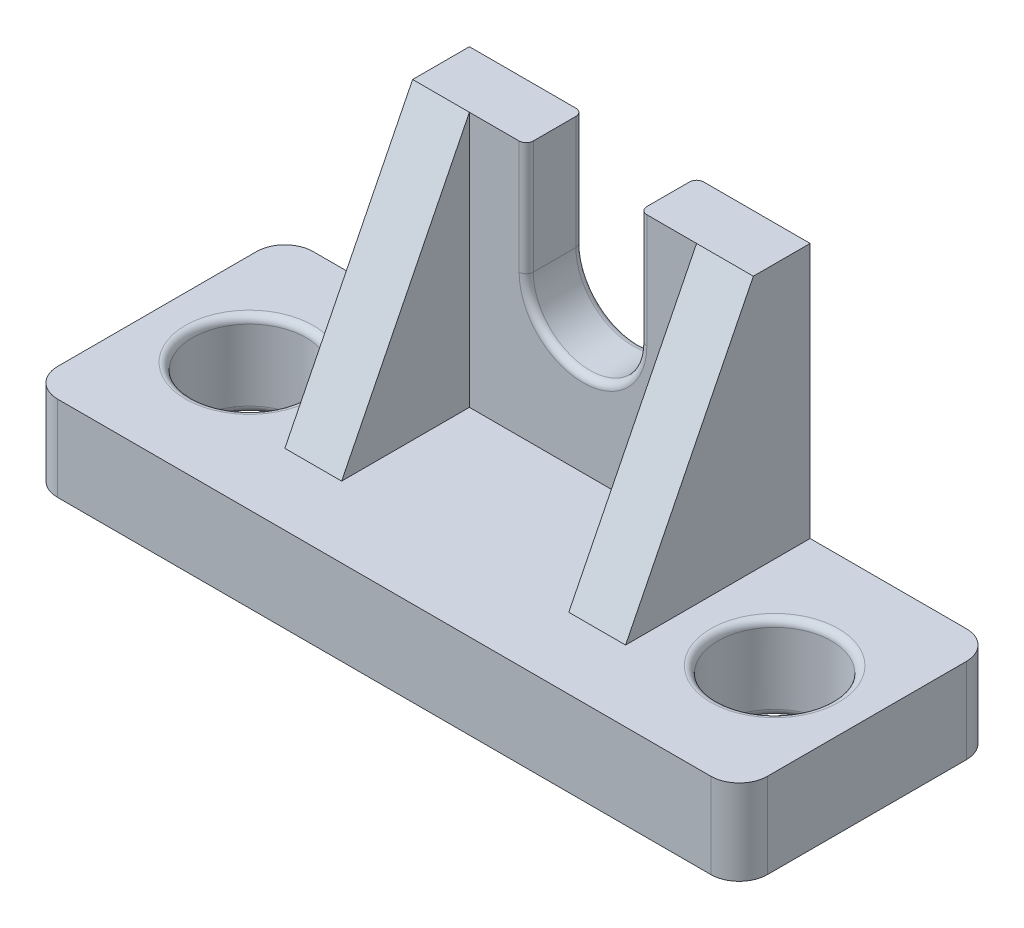
ISO-10303-21;
HEADER;
FILE_DESCRIPTION(('STEP AP214'),'2;1');
FILE_NAME('part.step','',(''),(''),'','','');
FILE_SCHEMA(('AUTOMOTIVE_DESIGN { 1 0 10303 214 1 1 1 1 }'));
ENDSEC;
DATA;
#1=APPLICATION_CONTEXT('core data for automotive mechanical design processes');
#2=APPLICATION_PROTOCOL_DEFINITION('international standard','automotive_design',2000,#1);
#3=PRODUCT_CONTEXT('',#1,'mechanical');
#4=PRODUCT('Part','Part','',(#3));
#5=PRODUCT_RELATED_PRODUCT_CATEGORY('part','',(#4));
#6=PRODUCT_DEFINITION_FORMATION('','',#4);
#7=PRODUCT_DEFINITION_CONTEXT('part definition',#1,'design');
#8=PRODUCT_DEFINITION('design','',#6,#7);
#9=PRODUCT_DEFINITION_SHAPE('','',#8);
#10=(LENGTH_UNIT() NAMED_UNIT(*) SI_UNIT(.MILLI.,.METRE.));
#11=(NAMED_UNIT(*) PLANE_ANGLE_UNIT() SI_UNIT($,.RADIAN.));
#12=(NAMED_UNIT(*) SI_UNIT($,.STERADIAN.) SOLID_ANGLE_UNIT());
#13=UNCERTAINTY_MEASURE_WITH_UNIT(LENGTH_MEASURE(1.E-05),#10,'distance_accuracy_value','');
#14=(GEOMETRIC_REPRESENTATION_CONTEXT(3) GLOBAL_UNCERTAINTY_ASSIGNED_CONTEXT((#13)) GLOBAL_UNIT_ASSIGNED_CONTEXT((#10,
#11,#12)) REPRESENTATION_CONTEXT('',''));
#15=CARTESIAN_POINT('',(0.,0.,0.));
#16=DIRECTION('',(0.,0.,1.));
#17=DIRECTION('',(1.,0.,0.));
#18=AXIS2_PLACEMENT_3D('',#15,#16,#17);
#19=CARTESIAN_POINT('',(0.,48.,0.));
#20=DIRECTION('',(0.,1.,0.));
#21=DIRECTION('',(0.,0.,1.));
#22=AXIS2_PLACEMENT_3D('',#19,#20,#21);
#23=PLANE('',#22);
#24=DIRECTION('',(0.,0.,1.));
#25=VECTOR('',#24,1.);
#26=CARTESIAN_POINT('',(42.,48.,-64.));
#27=LINE('',#26,#25);
#28=CARTESIAN_POINT('',(42.,48.,-35.));
#29=VERTEX_POINT('',#28);
#30=CARTESIAN_POINT('',(42.,48.,-29.));
#31=VERTEX_POINT('',#30);
#32=EDGE_CURVE('E381',#29,#31,#27,.T.);
#33=ORIENTED_EDGE('',*,*,#32,.F.);
#34=CARTESIAN_POINT('',(41.,48.,-35.));
#35=DIRECTION('',(0.,1.,0.));
#36=DIRECTION('',(0.,0.,1.));
#37=AXIS2_PLACEMENT_3D('',#34,#35,#36);
#38=CIRCLE('',#37,1.);
#39=CARTESIAN_POINT('',(41.,48.,-36.));
#40=VERTEX_POINT('',#39);
#41=EDGE_CURVE('E324',#29,#40,#38,.T.);
#42=ORIENTED_EDGE('',*,*,#41,.T.);
#43=DIRECTION('',(-1.,0.,0.));
#44=VECTOR('',#43,1.);
#45=CARTESIAN_POINT('',(26.,48.,-36.));
#46=LINE('',#45,#44);
#47=CARTESIAN_POINT('',(26.,48.,-36.));
#48=VERTEX_POINT('',#47);
#49=EDGE_CURVE('E219',#40,#48,#46,.T.);
#50=ORIENTED_EDGE('',*,*,#49,.T.);
#51=DIRECTION('',(0.,0.,1.));
#52=VECTOR('',#51,1.);
#53=CARTESIAN_POINT('',(26.,48.,-36.));
#54=LINE('',#53,#52);
#55=CARTESIAN_POINT('',(26.,48.,-28.));
#56=VERTEX_POINT('',#55);
#57=EDGE_CURVE('E220',#48,#56,#54,.T.);
#58=ORIENTED_EDGE('',*,*,#57,.T.);
#59=DIRECTION('',(-1.,0.,0.));
#60=VECTOR('',#59,1.);
#61=CARTESIAN_POINT('',(74.,48.,-28.));
#62=LINE('',#61,#60);
#63=CARTESIAN_POINT('',(34.,48.,-28.));
#64=VERTEX_POINT('',#63);
#65=EDGE_CURVE('E203',#64,#56,#62,.T.);
#66=ORIENTED_EDGE('',*,*,#65,.F.);
#67=DIRECTION('',(-1.,0.,0.));
#68=VECTOR('',#67,1.);
#69=CARTESIAN_POINT('',(34.,48.,-28.));
#70=LINE('',#69,#68);
#71=CARTESIAN_POINT('',(41.,48.,-28.));
#72=VERTEX_POINT('',#71);
#73=EDGE_CURVE('E392',#72,#64,#70,.T.);
#74=ORIENTED_EDGE('',*,*,#73,.F.);
#75=CARTESIAN_POINT('',(41.,48.,-29.));
#76=DIRECTION('',(0.,1.,0.));
#77=DIRECTION('',(0.,0.,1.));
#78=AXIS2_PLACEMENT_3D('',#75,#76,#77);
#79=CIRCLE('',#78,1.);
#80=EDGE_CURVE('E322',#72,#31,#79,.T.);
#81=ORIENTED_EDGE('',*,*,#80,.T.);
#82=EDGE_LOOP('',(#33,#42,#50,#58,#66,#74,#81));
#83=FACE_BOUND('',#82,.T.);
#84=ADVANCED_FACE('F37',(#83),#23,.T.);
#85=CARTESIAN_POINT('',(0.,0.,-36.));
#86=DIRECTION('',(-1.,0.,0.));
#87=DIRECTION('',(0.,0.,1.));
#88=AXIS2_PLACEMENT_3D('',#85,#86,#87);
#89=PLANE('',#88);
#90=DIRECTION('',(0.,0.,1.));
#91=VECTOR('',#90,1.);
#92=CARTESIAN_POINT('',(0.,12.,-36.));
#93=LINE('',#92,#91);
#94=CARTESIAN_POINT('',(0.,12.,-32.));
#95=VERTEX_POINT('',#94);
#96=CARTESIAN_POINT('',(0.,12.,-4.));
#97=VERTEX_POINT('',#96);
#98=EDGE_CURVE('E253',#95,#97,#93,.T.);
#99=ORIENTED_EDGE('',*,*,#98,.F.);
#100=DIRECTION('',(0.,-1.,0.));
#101=VECTOR('',#100,1.);
#102=CARTESIAN_POINT('',(0.,0.,-32.));
#103=LINE('',#102,#101);
#104=CARTESIAN_POINT('',(0.,0.,-32.));
#105=VERTEX_POINT('',#104);
#106=EDGE_CURVE('E299',#95,#105,#103,.T.);
#107=ORIENTED_EDGE('',*,*,#106,.T.);
#108=DIRECTION('',(0.,0.,1.));
#109=VECTOR('',#108,1.);
#110=CARTESIAN_POINT('',(0.,0.,-36.));
#111=LINE('',#110,#109);
#112=CARTESIAN_POINT('',(0.,0.,-4.));
#113=VERTEX_POINT('',#112);
#114=EDGE_CURVE('E248',#105,#113,#111,.T.);
#115=ORIENTED_EDGE('',*,*,#114,.T.);
#116=DIRECTION('',(0.,-1.,0.));
#117=VECTOR('',#116,1.);
#118=CARTESIAN_POINT('',(0.,12.,-4.));
#119=LINE('',#118,#117);
#120=EDGE_CURVE('E297',#113,#97,#119,.F.);
#121=ORIENTED_EDGE('',*,*,#120,.T.);
#122=EDGE_LOOP('',(#99,#107,#115,#121));
#123=FACE_BOUND('',#122,.T.);
#124=ADVANCED_FACE('F468',(#123),#89,.T.);
#125=CARTESIAN_POINT('',(0.,12.,-36.));
#126=DIRECTION('',(0.,1.,0.));
#127=DIRECTION('',(0.,0.,1.));
#128=AXIS2_PLACEMENT_3D('',#125,#126,#127);
#129=PLANE('',#128);
#130=CARTESIAN_POINT('',(87.,12.,-18.));
#131=DIRECTION('',(0.,1.,0.));
#132=DIRECTION('',(0.,0.,1.));
#133=AXIS2_PLACEMENT_3D('',#130,#131,#132);
#134=CIRCLE('',#133,9.);
#135=CARTESIAN_POINT('',(87.,12.,-9.));
#136=VERTEX_POINT('',#135);
#137=EDGE_CURVE('E351',#136,#136,#134,.F.);
#138=ORIENTED_EDGE('',*,*,#137,.T.);
#139=EDGE_LOOP('',(#138));
#140=FACE_BOUND('',#139,.T.);
#141=CARTESIAN_POINT('',(13.,12.,-18.));
#142=DIRECTION('',(0.,1.,0.));
#143=DIRECTION('',(0.,0.,1.));
#144=AXIS2_PLACEMENT_3D('',#141,#142,#143);
#145=CIRCLE('',#144,9.);
#146=CARTESIAN_POINT('',(13.,12.,-9.));
#147=VERTEX_POINT('',#146);
#148=EDGE_CURVE('E348',#147,#147,#145,.F.);
#149=ORIENTED_EDGE('',*,*,#148,.T.);
#150=EDGE_LOOP('',(#149));
#151=FACE_BOUND('',#150,.T.);
#152=DIRECTION('',(0.,0.,1.));
#153=VECTOR('',#152,1.);
#154=CARTESIAN_POINT('',(100.,12.,-36.));
#155=LINE('',#154,#153);
#156=CARTESIAN_POINT('',(100.,12.,-32.));
#157=VERTEX_POINT('',#156);
#158=CARTESIAN_POINT('',(100.,12.,-4.));
#159=VERTEX_POINT('',#158);
#160=EDGE_CURVE('E257',#157,#159,#155,.T.);
#161=ORIENTED_EDGE('',*,*,#160,.F.);
#162=CARTESIAN_POINT('',(96.,12.,-32.));
#163=DIRECTION('',(0.,1.,0.));
#164=DIRECTION('',(0.,0.,1.));
#165=AXIS2_PLACEMENT_3D('',#162,#163,#164);
#166=CIRCLE('',#165,4.);
#167=CARTESIAN_POINT('',(96.,12.,-36.));
#168=VERTEX_POINT('',#167);
#169=EDGE_CURVE('E277',#157,#168,#166,.T.);
#170=ORIENTED_EDGE('',*,*,#169,.T.);
#171=DIRECTION('',(-1.,0.,0.));
#172=VECTOR('',#171,1.);
#173=CARTESIAN_POINT('',(0.,12.,-36.));
#174=LINE('',#173,#172);
#175=CARTESIAN_POINT('',(74.,12.,-36.));
#176=VERTEX_POINT('',#175);
#177=EDGE_CURVE('E246',#168,#176,#174,.T.);
#178=ORIENTED_EDGE('',*,*,#177,.T.);
#179=DIRECTION('',(0.,0.,-1.));
#180=VECTOR('',#179,1.);
#181=CARTESIAN_POINT('',(74.,12.,-36.));
#182=LINE('',#181,#180);
#183=CARTESIAN_POINT('',(74.,12.,-10.));
#184=VERTEX_POINT('',#183);
#185=EDGE_CURVE('E225',#184,#176,#182,.T.);
#186=ORIENTED_EDGE('',*,*,#185,.F.);
#187=DIRECTION('',(1.,0.,0.));
#188=VECTOR('',#187,1.);
#189=CARTESIAN_POINT('',(26.,12.,-9.99999999999999));
#190=LINE('',#189,#188);
#191=CARTESIAN_POINT('',(66.,12.,-10.));
#192=VERTEX_POINT('',#191);
#193=EDGE_CURVE('E198',#192,#184,#190,.T.);
#194=ORIENTED_EDGE('',*,*,#193,.F.);
#195=DIRECTION('',(0.,0.,-1.));
#196=VECTOR('',#195,1.);
#197=CARTESIAN_POINT('',(66.,12.,-9.99999999999999));
#198=LINE('',#197,#196);
#199=CARTESIAN_POINT('',(66.,12.,-28.));
#200=VERTEX_POINT('',#199);
#201=EDGE_CURVE('E396',#192,#200,#198,.T.);
#202=ORIENTED_EDGE('',*,*,#201,.T.);
#203=DIRECTION('',(-1.,0.,0.));
#204=VECTOR('',#203,1.);
#205=CARTESIAN_POINT('',(34.,12.,-28.));
#206=LINE('',#205,#204);
#207=CARTESIAN_POINT('',(34.,12.,-28.));
#208=VERTEX_POINT('',#207);
#209=EDGE_CURVE('E399',#200,#208,#206,.T.);
#210=ORIENTED_EDGE('',*,*,#209,.T.);
#211=DIRECTION('',(0.,0.,1.));
#212=VECTOR('',#211,1.);
#213=CARTESIAN_POINT('',(34.,12.,-9.99999999999999));
#214=LINE('',#213,#212);
#215=CARTESIAN_POINT('',(34.,12.,-9.99999999999999));
#216=VERTEX_POINT('',#215);
#217=EDGE_CURVE('E393',#208,#216,#214,.T.);
#218=ORIENTED_EDGE('',*,*,#217,.T.);
#219=CARTESIAN_POINT('',(26.,12.,-9.99999999999999));
#220=VERTEX_POINT('',#219);
#221=EDGE_CURVE('E234',#220,#216,#190,.T.);
#222=ORIENTED_EDGE('',*,*,#221,.F.);
#223=DIRECTION('',(0.,0.,1.));
#224=VECTOR('',#223,1.);
#225=CARTESIAN_POINT('',(26.,12.,-36.));
#226=LINE('',#225,#224);
#227=CARTESIAN_POINT('',(26.,12.,-36.));
#228=VERTEX_POINT('',#227);
#229=EDGE_CURVE('E230',#228,#220,#226,.T.);
#230=ORIENTED_EDGE('',*,*,#229,.F.);
#231=CARTESIAN_POINT('',(4.,12.,-36.));
#232=VERTEX_POINT('',#231);
#233=EDGE_CURVE('E244',#228,#232,#174,.T.);
#234=ORIENTED_EDGE('',*,*,#233,.T.);
#235=CARTESIAN_POINT('',(4.,12.,-32.));
#236=DIRECTION('',(0.,1.,0.));
#237=DIRECTION('',(0.,0.,1.));
#238=AXIS2_PLACEMENT_3D('',#235,#236,#237);
#239=CIRCLE('',#238,4.);
#240=EDGE_CURVE('E273',#232,#95,#239,.T.);
#241=ORIENTED_EDGE('',*,*,#240,.T.);
#242=ORIENTED_EDGE('',*,*,#98,.T.);
#243=CARTESIAN_POINT('',(4.,12.,-4.));
#244=DIRECTION('',(0.,1.,0.));
#245=DIRECTION('',(0.,0.,1.));
#246=AXIS2_PLACEMENT_3D('',#243,#244,#245);
#247=CIRCLE('',#246,4.);
#248=CARTESIAN_POINT('',(4.,12.,0.));
#249=VERTEX_POINT('',#248);
#250=EDGE_CURVE('E271',#97,#249,#247,.T.);
#251=ORIENTED_EDGE('',*,*,#250,.T.);
#252=DIRECTION('',(-1.,0.,0.));
#253=VECTOR('',#252,1.);
#254=CARTESIAN_POINT('',(0.,12.,0.));
#255=LINE('',#254,#253);
#256=CARTESIAN_POINT('',(96.,12.,0.));
#257=VERTEX_POINT('',#256);
#258=EDGE_CURVE('E245',#257,#249,#255,.T.);
#259=ORIENTED_EDGE('',*,*,#258,.F.);
#260=CARTESIAN_POINT('',(96.,12.,-4.));
#261=DIRECTION('',(0.,1.,0.));
#262=DIRECTION('',(0.,0.,1.));
#263=AXIS2_PLACEMENT_3D('',#260,#261,#262);
#264=CIRCLE('',#263,4.);
#265=EDGE_CURVE('E275',#257,#159,#264,.T.);
#266=ORIENTED_EDGE('',*,*,#265,.T.);
#267=EDGE_LOOP('',(#161,#170,#178,#186,#194,#202,#210,#218,#222,#230,#234,#241,#242,#251,#259,#266));
#268=FACE_BOUND('',#267,.T.);
#269=ADVANCED_FACE('F413',(#140,#151,#268),#129,.T.);
#270=CARTESIAN_POINT('',(100.,0.,-36.));
#271=DIRECTION('',(1.,0.,0.));
#272=DIRECTION('',(0.,0.,-1.));
#273=AXIS2_PLACEMENT_3D('',#270,#271,#272);
#274=PLANE('',#273);
#275=DIRECTION('',(0.,0.,1.));
#276=VECTOR('',#275,1.);
#277=CARTESIAN_POINT('',(100.,0.,-36.));
#278=LINE('',#277,#276);
#279=CARTESIAN_POINT('',(100.,0.,-32.));
#280=VERTEX_POINT('',#279);
#281=CARTESIAN_POINT('',(100.,0.,-4.));
#282=VERTEX_POINT('',#281);
#283=EDGE_CURVE('E260',#280,#282,#278,.T.);
#284=ORIENTED_EDGE('',*,*,#283,.F.);
#285=DIRECTION('',(0.,1.,0.));
#286=VECTOR('',#285,1.);
#287=CARTESIAN_POINT('',(100.,0.,-32.));
#288=LINE('',#287,#286);
#289=EDGE_CURVE('E268',#280,#157,#288,.T.);
#290=ORIENTED_EDGE('',*,*,#289,.T.);
#291=ORIENTED_EDGE('',*,*,#160,.T.);
#292=DIRECTION('',(0.,1.,0.));
#293=VECTOR('',#292,1.);
#294=CARTESIAN_POINT('',(100.,0.,-4.));
#295=LINE('',#294,#293);
#296=EDGE_CURVE('E266',#159,#282,#295,.F.);
#297=ORIENTED_EDGE('',*,*,#296,.T.);
#298=EDGE_LOOP('',(#284,#290,#291,#297));
#299=FACE_BOUND('',#298,.T.);
#300=ADVANCED_FACE('F496',(#299),#274,.T.);
#301=CARTESIAN_POINT('',(0.,0.,-36.));
#302=DIRECTION('',(0.,-1.,0.));
#303=DIRECTION('',(0.,0.,-1.));
#304=AXIS2_PLACEMENT_3D('',#301,#302,#303);
#305=PLANE('',#304);
#306=CARTESIAN_POINT('',(13.,0.,-18.));
#307=DIRECTION('',(0.,-1.,0.));
#308=DIRECTION('',(0.,0.,-1.));
#309=AXIS2_PLACEMENT_3D('',#306,#307,#308);
#310=CIRCLE('',#309,9.);
#311=CARTESIAN_POINT('',(13.,0.,-27.));
#312=VERTEX_POINT('',#311);
#313=EDGE_CURVE('E339',#312,#312,#310,.F.);
#314=ORIENTED_EDGE('',*,*,#313,.T.);
#315=EDGE_LOOP('',(#314));
#316=FACE_BOUND('',#315,.T.);
#317=CARTESIAN_POINT('',(87.,0.,-18.));
#318=DIRECTION('',(0.,-1.,0.));
#319=DIRECTION('',(0.,0.,-1.));
#320=AXIS2_PLACEMENT_3D('',#317,#318,#319);
#321=CIRCLE('',#320,9.);
#322=CARTESIAN_POINT('',(87.,0.,-27.));
#323=VERTEX_POINT('',#322);
#324=EDGE_CURVE('E336',#323,#323,#321,.F.);
#325=ORIENTED_EDGE('',*,*,#324,.T.);
#326=EDGE_LOOP('',(#325));
#327=FACE_BOUND('',#326,.T.);
#328=DIRECTION('',(1.,0.,0.));
#329=VECTOR('',#328,1.);
#330=CARTESIAN_POINT('',(0.,0.,-36.));
#331=LINE('',#330,#329);
#332=CARTESIAN_POINT('',(4.,0.,-36.));
#333=VERTEX_POINT('',#332);
#334=CARTESIAN_POINT('',(96.,0.,-36.));
#335=VERTEX_POINT('',#334);
#336=EDGE_CURVE('E241',#333,#335,#331,.T.);
#337=ORIENTED_EDGE('',*,*,#336,.T.);
#338=CARTESIAN_POINT('',(96.,0.,-32.));
#339=DIRECTION('',(0.,-1.,0.));
#340=DIRECTION('',(0.,0.,-1.));
#341=AXIS2_PLACEMENT_3D('',#338,#339,#340);
#342=CIRCLE('',#341,4.);
#343=EDGE_CURVE('E289',#335,#280,#342,.T.);
#344=ORIENTED_EDGE('',*,*,#343,.T.);
#345=ORIENTED_EDGE('',*,*,#283,.T.);
#346=CARTESIAN_POINT('',(96.,0.,-4.));
#347=DIRECTION('',(0.,-1.,0.));
#348=DIRECTION('',(0.,0.,-1.));
#349=AXIS2_PLACEMENT_3D('',#346,#347,#348);
#350=CIRCLE('',#349,4.);
#351=CARTESIAN_POINT('',(96.,0.,0.));
#352=VERTEX_POINT('',#351);
#353=EDGE_CURVE('E287',#282,#352,#350,.T.);
#354=ORIENTED_EDGE('',*,*,#353,.T.);
#355=DIRECTION('',(1.,0.,0.));
#356=VECTOR('',#355,1.);
#357=CARTESIAN_POINT('',(0.,0.,0.));
#358=LINE('',#357,#356);
#359=CARTESIAN_POINT('',(4.,0.,0.));
#360=VERTEX_POINT('',#359);
#361=EDGE_CURVE('E240',#360,#352,#358,.T.);
#362=ORIENTED_EDGE('',*,*,#361,.F.);
#363=CARTESIAN_POINT('',(4.,0.,-4.));
#364=DIRECTION('',(0.,-1.,0.));
#365=DIRECTION('',(0.,0.,-1.));
#366=AXIS2_PLACEMENT_3D('',#363,#364,#365);
#367=CIRCLE('',#366,4.);
#368=EDGE_CURVE('E283',#360,#113,#367,.T.);
#369=ORIENTED_EDGE('',*,*,#368,.T.);
#370=ORIENTED_EDGE('',*,*,#114,.F.);
#371=CARTESIAN_POINT('',(4.,0.,-32.));
#372=DIRECTION('',(0.,-1.,0.));
#373=DIRECTION('',(0.,0.,-1.));
#374=AXIS2_PLACEMENT_3D('',#371,#372,#373);
#375=CIRCLE('',#374,4.);
#376=EDGE_CURVE('E285',#105,#333,#375,.T.);
#377=ORIENTED_EDGE('',*,*,#376,.T.);
#378=EDGE_LOOP('',(#337,#344,#345,#354,#362,#369,#370,#377));
#379=FACE_BOUND('',#378,.T.);
#380=ADVANCED_FACE('F490',(#316,#327,#379),#305,.T.);
#381=CARTESIAN_POINT('',(0.,0.,-36.));
#382=DIRECTION('',(0.,0.,-1.));
#383=DIRECTION('',(-1.,0.,0.));
#384=AXIS2_PLACEMENT_3D('',#381,#382,#383);
#385=PLANE('',#384);
#386=CARTESIAN_POINT('',(50.,32.,-36.));
#387=DIRECTION('',(0.,0.,-1.));
#388=DIRECTION('',(-1.,0.,0.));
#389=AXIS2_PLACEMENT_3D('',#386,#387,#388);
#390=CIRCLE('',#389,9.);
#391=CARTESIAN_POINT('',(41.,32.,-36.));
#392=VERTEX_POINT('',#391);
#393=CARTESIAN_POINT('',(59.,32.,-36.));
#394=VERTEX_POINT('',#393);
#395=EDGE_CURVE('E307',#392,#394,#390,.F.);
#396=ORIENTED_EDGE('',*,*,#395,.T.);
#397=DIRECTION('',(0.,-1.,0.));
#398=VECTOR('',#397,1.);
#399=CARTESIAN_POINT('',(59.,48.,-36.));
#400=LINE('',#399,#398);
#401=CARTESIAN_POINT('',(59.,48.,-36.));
#402=VERTEX_POINT('',#401);
#403=EDGE_CURVE('E311',#394,#402,#400,.F.);
#404=ORIENTED_EDGE('',*,*,#403,.T.);
#405=CARTESIAN_POINT('',(74.,48.,-36.));
#406=VERTEX_POINT('',#405);
#407=EDGE_CURVE('E222',#406,#402,#46,.T.);
#408=ORIENTED_EDGE('',*,*,#407,.F.);
#409=DIRECTION('',(0.,-1.,0.));
#410=VECTOR('',#409,1.);
#411=CARTESIAN_POINT('',(74.,48.,-36.));
#412=LINE('',#411,#410);
#413=EDGE_CURVE('E217',#406,#176,#412,.T.);
#414=ORIENTED_EDGE('',*,*,#413,.T.);
#415=ORIENTED_EDGE('',*,*,#177,.F.);
#416=DIRECTION('',(0.,1.,0.));
#417=VECTOR('',#416,1.);
#418=CARTESIAN_POINT('',(96.,0.,-36.));
#419=LINE('',#418,#417);
#420=EDGE_CURVE('E281',#168,#335,#419,.F.);
#421=ORIENTED_EDGE('',*,*,#420,.T.);
#422=ORIENTED_EDGE('',*,*,#336,.F.);
#423=DIRECTION('',(0.,-1.,0.));
#424=VECTOR('',#423,1.);
#425=CARTESIAN_POINT('',(4.,0.,-36.));
#426=LINE('',#425,#424);
#427=EDGE_CURVE('E279',#333,#232,#426,.F.);
#428=ORIENTED_EDGE('',*,*,#427,.T.);
#429=ORIENTED_EDGE('',*,*,#233,.F.);
#430=DIRECTION('',(0.,-1.,0.));
#431=VECTOR('',#430,1.);
#432=CARTESIAN_POINT('',(26.,48.,-36.));
#433=LINE('',#432,#431);
#434=EDGE_CURVE('E229',#48,#228,#433,.T.);
#435=ORIENTED_EDGE('',*,*,#434,.F.);
#436=ORIENTED_EDGE('',*,*,#49,.F.);
#437=DIRECTION('',(0.,1.,0.));
#438=VECTOR('',#437,1.);
#439=CARTESIAN_POINT('',(41.,32.,-36.));
#440=LINE('',#439,#438);
#441=EDGE_CURVE('E309',#40,#392,#440,.F.);
#442=ORIENTED_EDGE('',*,*,#441,.T.);
#443=EDGE_LOOP('',(#396,#404,#408,#414,#415,#421,#422,#428,#429,#435,#436,#442));
#444=FACE_BOUND('',#443,.T.);
#445=ADVANCED_FACE('F416',(#444),#385,.T.);
#446=CARTESIAN_POINT('',(0.,0.,0.));
#447=DIRECTION('',(0.,0.,-1.));
#448=DIRECTION('',(-1.,0.,0.));
#449=AXIS2_PLACEMENT_3D('',#446,#447,#448);
#450=PLANE('',#449);
#451=ORIENTED_EDGE('',*,*,#361,.T.);
#452=DIRECTION('',(0.,1.,0.));
#453=VECTOR('',#452,1.);
#454=CARTESIAN_POINT('',(96.,12.,0.));
#455=LINE('',#454,#453);
#456=EDGE_CURVE('E294',#352,#257,#455,.T.);
#457=ORIENTED_EDGE('',*,*,#456,.T.);
#458=ORIENTED_EDGE('',*,*,#258,.T.);
#459=DIRECTION('',(0.,-1.,0.));
#460=VECTOR('',#459,1.);
#461=CARTESIAN_POINT('',(4.,0.,0.));
#462=LINE('',#461,#460);
#463=EDGE_CURVE('E291',#249,#360,#462,.T.);
#464=ORIENTED_EDGE('',*,*,#463,.T.);
#465=EDGE_LOOP('',(#451,#457,#458,#464));
#466=FACE_BOUND('',#465,.T.);
#467=ADVANCED_FACE('F485',(#466),#450,.F.);
#468=CARTESIAN_POINT('',(26.,48.,-36.));
#469=DIRECTION('',(1.,0.,0.));
#470=DIRECTION('',(0.,0.,-1.));
#471=AXIS2_PLACEMENT_3D('',#468,#469,#470);
#472=PLANE('',#471);
#473=ORIENTED_EDGE('',*,*,#229,.T.);
#474=DIRECTION('',(0.,-0.894427190999916,0.447213595499958));
#475=VECTOR('',#474,1.);
#476=CARTESIAN_POINT('',(26.,48.,-28.));
#477=LINE('',#476,#475);
#478=EDGE_CURVE('E204',#56,#220,#477,.T.);
#479=ORIENTED_EDGE('',*,*,#478,.F.);
#480=ORIENTED_EDGE('',*,*,#57,.F.);
#481=ORIENTED_EDGE('',*,*,#434,.T.);
#482=EDGE_LOOP('',(#473,#479,#480,#481));
#483=FACE_BOUND('',#482,.T.);
#484=ADVANCED_FACE('F457',(#483),#472,.F.);
#485=CARTESIAN_POINT('',(74.,48.,-36.));
#486=DIRECTION('',(-1.,0.,0.));
#487=DIRECTION('',(0.,0.,1.));
#488=AXIS2_PLACEMENT_3D('',#485,#486,#487);
#489=PLANE('',#488);
#490=DIRECTION('',(0.,0.,-1.));
#491=VECTOR('',#490,1.);
#492=CARTESIAN_POINT('',(74.,48.,-36.));
#493=LINE('',#492,#491);
#494=CARTESIAN_POINT('',(74.,48.,-28.));
#495=VERTEX_POINT('',#494);
#496=EDGE_CURVE('E210',#495,#406,#493,.T.);
#497=ORIENTED_EDGE('',*,*,#496,.F.);
#498=DIRECTION('',(0.,-0.894427190999916,0.447213595499958));
#499=VECTOR('',#498,1.);
#500=CARTESIAN_POINT('',(74.,48.,-28.));
#501=LINE('',#500,#499);
#502=EDGE_CURVE('E192',#495,#184,#501,.T.);
#503=ORIENTED_EDGE('',*,*,#502,.T.);
#504=ORIENTED_EDGE('',*,*,#185,.T.);
#505=ORIENTED_EDGE('',*,*,#413,.F.);
#506=EDGE_LOOP('',(#497,#503,#504,#505));
#507=FACE_BOUND('',#506,.T.);
#508=ADVANCED_FACE('F215',(#507),#489,.F.);
#509=ORIENTED_EDGE('',*,*,#407,.T.);
#510=CARTESIAN_POINT('',(59.,48.,-35.));
#511=DIRECTION('',(0.,1.,0.));
#512=DIRECTION('',(0.,0.,1.));
#513=AXIS2_PLACEMENT_3D('',#510,#511,#512);
#514=CIRCLE('',#513,1.);
#515=CARTESIAN_POINT('',(58.,48.,-35.));
#516=VERTEX_POINT('',#515);
#517=EDGE_CURVE('E315',#402,#516,#514,.T.);
#518=ORIENTED_EDGE('',*,*,#517,.T.);
#519=DIRECTION('',(0.,0.,1.));
#520=VECTOR('',#519,1.);
#521=CARTESIAN_POINT('',(58.,48.,-64.));
#522=LINE('',#521,#520);
#523=CARTESIAN_POINT('',(58.,48.,-29.));
#524=VERTEX_POINT('',#523);
#525=EDGE_CURVE('E377',#516,#524,#522,.T.);
#526=ORIENTED_EDGE('',*,*,#525,.T.);
#527=CARTESIAN_POINT('',(59.,48.,-29.));
#528=DIRECTION('',(0.,1.,0.));
#529=DIRECTION('',(0.,0.,1.));
#530=AXIS2_PLACEMENT_3D('',#527,#528,#529);
#531=CIRCLE('',#530,1.);
#532=CARTESIAN_POINT('',(59.,48.,-28.));
#533=VERTEX_POINT('',#532);
#534=EDGE_CURVE('E313',#524,#533,#531,.T.);
#535=ORIENTED_EDGE('',*,*,#534,.T.);
#536=CARTESIAN_POINT('',(66.,48.,-28.));
#537=VERTEX_POINT('',#536);
#538=EDGE_CURVE('E212',#537,#533,#70,.T.);
#539=ORIENTED_EDGE('',*,*,#538,.F.);
#540=EDGE_CURVE('E195',#495,#537,#62,.T.);
#541=ORIENTED_EDGE('',*,*,#540,.F.);
#542=ORIENTED_EDGE('',*,*,#496,.T.);
#543=EDGE_LOOP('',(#509,#518,#526,#535,#539,#541,#542));
#544=FACE_BOUND('',#543,.T.);
#545=ADVANCED_FACE('F209',(#544),#23,.T.);
#546=CARTESIAN_POINT('',(34.,12.,-9.99999999999999));
#547=DIRECTION('',(-1.,0.,0.));
#548=DIRECTION('',(0.,0.,1.));
#549=AXIS2_PLACEMENT_3D('',#546,#547,#548);
#550=PLANE('',#549);
#551=DIRECTION('',(0.,1.,0.));
#552=VECTOR('',#551,1.);
#553=CARTESIAN_POINT('',(34.,12.,-28.));
#554=LINE('',#553,#552);
#555=EDGE_CURVE('E233',#208,#64,#554,.T.);
#556=ORIENTED_EDGE('',*,*,#555,.T.);
#557=DIRECTION('',(0.,-0.894427190999916,0.447213595499958));
#558=VECTOR('',#557,1.);
#559=CARTESIAN_POINT('',(34.,12.,-10.));
#560=LINE('',#559,#558);
#561=EDGE_CURVE('E213',#64,#216,#560,.T.);
#562=ORIENTED_EDGE('',*,*,#561,.T.);
#563=ORIENTED_EDGE('',*,*,#217,.F.);
#564=EDGE_LOOP('',(#556,#562,#563));
#565=FACE_BOUND('',#564,.T.);
#566=ADVANCED_FACE('F453',(#565),#550,.F.);
#567=CARTESIAN_POINT('',(34.,12.,-28.));
#568=DIRECTION('',(0.,0.,-1.));
#569=DIRECTION('',(-1.,0.,0.));
#570=AXIS2_PLACEMENT_3D('',#567,#568,#569);
#571=PLANE('',#570);
#572=CARTESIAN_POINT('',(50.,32.,-28.));
#573=DIRECTION('',(0.,0.,-1.));
#574=DIRECTION('',(-1.,0.,0.));
#575=AXIS2_PLACEMENT_3D('',#572,#573,#574);
#576=CIRCLE('',#575,9.);
#577=CARTESIAN_POINT('',(59.,32.,-28.));
#578=VERTEX_POINT('',#577);
#579=CARTESIAN_POINT('',(41.,32.,-28.));
#580=VERTEX_POINT('',#579);
#581=EDGE_CURVE('E54',#578,#580,#576,.T.);
#582=ORIENTED_EDGE('',*,*,#581,.T.);
#583=DIRECTION('',(0.,-1.,0.));
#584=VECTOR('',#583,1.);
#585=CARTESIAN_POINT('',(41.,12.,-28.));
#586=LINE('',#585,#584);
#587=EDGE_CURVE('E328',#580,#72,#586,.F.);
#588=ORIENTED_EDGE('',*,*,#587,.T.);
#589=ORIENTED_EDGE('',*,*,#73,.T.);
#590=ORIENTED_EDGE('',*,*,#555,.F.);
#591=ORIENTED_EDGE('',*,*,#209,.F.);
#592=DIRECTION('',(0.,1.,0.));
#593=VECTOR('',#592,1.);
#594=CARTESIAN_POINT('',(66.,12.,-28.));
#595=LINE('',#594,#593);
#596=EDGE_CURVE('E402',#200,#537,#595,.T.);
#597=ORIENTED_EDGE('',*,*,#596,.T.);
#598=ORIENTED_EDGE('',*,*,#538,.T.);
#599=DIRECTION('',(0.,1.,0.));
#600=VECTOR('',#599,1.);
#601=CARTESIAN_POINT('',(59.,12.,-28.));
#602=LINE('',#601,#600);
#603=EDGE_CURVE('E59',#533,#578,#602,.F.);
#604=ORIENTED_EDGE('',*,*,#603,.T.);
#605=EDGE_LOOP('',(#582,#588,#589,#590,#591,#597,#598,#604));
#606=FACE_BOUND('',#605,.T.);
#607=ADVANCED_FACE('F407',(#606),#571,.F.);
#608=CARTESIAN_POINT('',(66.,12.,-9.99999999999999));
#609=DIRECTION('',(1.,0.,0.));
#610=DIRECTION('',(0.,0.,-1.));
#611=AXIS2_PLACEMENT_3D('',#608,#609,#610);
#612=PLANE('',#611);
#613=ORIENTED_EDGE('',*,*,#201,.F.);
#614=DIRECTION('',(0.,0.894427190999916,-0.447213595499958));
#615=VECTOR('',#614,1.);
#616=CARTESIAN_POINT('',(66.,12.,-10.));
#617=LINE('',#616,#615);
#618=EDGE_CURVE('E256',#192,#537,#617,.T.);
#619=ORIENTED_EDGE('',*,*,#618,.T.);
#620=ORIENTED_EDGE('',*,*,#596,.F.);
#621=EDGE_LOOP('',(#613,#619,#620));
#622=FACE_BOUND('',#621,.T.);
#623=ADVANCED_FACE('F410',(#622),#612,.F.);
#624=CARTESIAN_POINT('',(74.,48.,-28.));
#625=DIRECTION('',(0.,-0.447213595499958,-0.894427190999916));
#626=DIRECTION('',(0.,0.894427190999916,-0.447213595499958));
#627=AXIS2_PLACEMENT_3D('',#624,#625,#626);
#628=PLANE('',#627);
#629=ORIENTED_EDGE('',*,*,#193,.T.);
#630=ORIENTED_EDGE('',*,*,#502,.F.);
#631=ORIENTED_EDGE('',*,*,#540,.T.);
#632=ORIENTED_EDGE('',*,*,#618,.F.);
#633=EDGE_LOOP('',(#629,#630,#631,#632));
#634=FACE_BOUND('',#633,.T.);
#635=ADVANCED_FACE('F194',(#634),#628,.F.);
#636=ORIENTED_EDGE('',*,*,#65,.T.);
#637=ORIENTED_EDGE('',*,*,#478,.T.);
#638=ORIENTED_EDGE('',*,*,#221,.T.);
#639=ORIENTED_EDGE('',*,*,#561,.F.);
#640=EDGE_LOOP('',(#636,#637,#638,#639));
#641=FACE_BOUND('',#640,.T.);
#642=ADVANCED_FACE('F458',(#641),#628,.F.);
#643=CARTESIAN_POINT('',(50.,32.,-64.));
#644=DIRECTION('',(0.,0.,1.));
#645=DIRECTION('',(1.,0.,0.));
#646=AXIS2_PLACEMENT_3D('',#643,#644,#645);
#647=CYLINDRICAL_SURFACE('',#646,8.);
#648=DIRECTION('',(0.,0.,1.));
#649=VECTOR('',#648,1.);
#650=CARTESIAN_POINT('',(58.,32.,-64.));
#651=LINE('',#650,#649);
#652=CARTESIAN_POINT('',(58.,32.,-35.));
#653=VERTEX_POINT('',#652);
#654=CARTESIAN_POINT('',(58.,32.,-29.));
#655=VERTEX_POINT('',#654);
#656=EDGE_CURVE('E359',#653,#655,#651,.T.);
#657=ORIENTED_EDGE('',*,*,#656,.F.);
#658=CARTESIAN_POINT('',(50.,32.,-35.));
#659=DIRECTION('',(0.,0.,-1.));
#660=DIRECTION('',(-1.,0.,0.));
#661=AXIS2_PLACEMENT_3D('',#658,#659,#660);
#662=CIRCLE('',#661,8.);
#663=CARTESIAN_POINT('',(42.,32.,-35.));
#664=VERTEX_POINT('',#663);
#665=EDGE_CURVE('E11',#653,#664,#662,.T.);
#666=ORIENTED_EDGE('',*,*,#665,.T.);
#667=DIRECTION('',(0.,0.,1.));
#668=VECTOR('',#667,1.);
#669=CARTESIAN_POINT('',(42.,32.,-64.));
#670=LINE('',#669,#668);
#671=CARTESIAN_POINT('',(42.,32.,-29.));
#672=VERTEX_POINT('',#671);
#673=EDGE_CURVE('E384',#664,#672,#670,.T.);
#674=ORIENTED_EDGE('',*,*,#673,.T.);
#675=CARTESIAN_POINT('',(50.,32.,-29.));
#676=DIRECTION('',(0.,0.,-1.));
#677=DIRECTION('',(-1.,0.,0.));
#678=AXIS2_PLACEMENT_3D('',#675,#676,#677);
#679=CIRCLE('',#678,8.);
#680=EDGE_CURVE('E46',#672,#655,#679,.F.);
#681=ORIENTED_EDGE('',*,*,#680,.T.);
#682=EDGE_LOOP('',(#657,#666,#674,#681));
#683=FACE_BOUND('',#682,.T.);
#684=ADVANCED_FACE('F424',(#683),#647,.F.);
#685=CARTESIAN_POINT('',(42.,32.,-64.));
#686=DIRECTION('',(-1.,0.,0.));
#687=DIRECTION('',(0.,0.,1.));
#688=AXIS2_PLACEMENT_3D('',#685,#686,#687);
#689=PLANE('',#688);
#690=ORIENTED_EDGE('',*,*,#673,.F.);
#691=DIRECTION('',(0.,1.,0.));
#692=VECTOR('',#691,1.);
#693=CARTESIAN_POINT('',(42.,48.,-35.));
#694=LINE('',#693,#692);
#695=EDGE_CURVE('E320',#664,#29,#694,.T.);
#696=ORIENTED_EDGE('',*,*,#695,.T.);
#697=ORIENTED_EDGE('',*,*,#32,.T.);
#698=DIRECTION('',(0.,-1.,0.));
#699=VECTOR('',#698,1.);
#700=CARTESIAN_POINT('',(42.,32.,-29.));
#701=LINE('',#700,#699);
#702=EDGE_CURVE('E317',#31,#672,#701,.T.);
#703=ORIENTED_EDGE('',*,*,#702,.T.);
#704=EDGE_LOOP('',(#690,#696,#697,#703));
#705=FACE_BOUND('',#704,.T.);
#706=ADVANCED_FACE('F429',(#705),#689,.F.);
#707=CARTESIAN_POINT('',(58.,32.,-64.));
#708=DIRECTION('',(1.,0.,0.));
#709=DIRECTION('',(0.,0.,-1.));
#710=AXIS2_PLACEMENT_3D('',#707,#708,#709);
#711=PLANE('',#710);
#712=ORIENTED_EDGE('',*,*,#525,.F.);
#713=DIRECTION('',(0.,-1.,0.));
#714=VECTOR('',#713,1.);
#715=CARTESIAN_POINT('',(58.,32.,-35.));
#716=LINE('',#715,#714);
#717=EDGE_CURVE('E304',#516,#653,#716,.T.);
#718=ORIENTED_EDGE('',*,*,#717,.T.);
#719=ORIENTED_EDGE('',*,*,#656,.T.);
#720=DIRECTION('',(0.,1.,0.));
#721=VECTOR('',#720,1.);
#722=CARTESIAN_POINT('',(58.,32.,-29.));
#723=LINE('',#722,#721);
#724=EDGE_CURVE('E302',#655,#524,#723,.T.);
#725=ORIENTED_EDGE('',*,*,#724,.T.);
#726=EDGE_LOOP('',(#712,#718,#719,#725));
#727=FACE_BOUND('',#726,.T.);
#728=ADVANCED_FACE('F376',(#727),#711,.F.);
#729=CARTESIAN_POINT('',(13.,-24.,-18.));
#730=DIRECTION('',(0.,1.,0.));
#731=DIRECTION('',(0.,0.,1.));
#732=AXIS2_PLACEMENT_3D('',#729,#730,#731);
#733=CYLINDRICAL_SURFACE('',#732,8.);
#734=CARTESIAN_POINT('',(13.,1.,-18.));
#735=DIRECTION('',(0.,-1.,0.));
#736=DIRECTION('',(0.,0.,-1.));
#737=AXIS2_PLACEMENT_3D('',#734,#735,#736);
#738=CIRCLE('',#737,8.);
#739=CARTESIAN_POINT('',(13.,1.,-26.));
#740=VERTEX_POINT('',#739);
#741=EDGE_CURVE('E333',#740,#740,#738,.T.);
#742=ORIENTED_EDGE('',*,*,#741,.T.);
#743=EDGE_LOOP('',(#742));
#744=FACE_BOUND('',#743,.T.);
#745=CARTESIAN_POINT('',(13.,11.,-18.));
#746=DIRECTION('',(0.,1.,0.));
#747=DIRECTION('',(0.,0.,1.));
#748=AXIS2_PLACEMENT_3D('',#745,#746,#747);
#749=CIRCLE('',#748,8.);
#750=CARTESIAN_POINT('',(13.,11.,-10.));
#751=VERTEX_POINT('',#750);
#752=EDGE_CURVE('E330',#751,#751,#749,.T.);
#753=ORIENTED_EDGE('',*,*,#752,.T.);
#754=EDGE_LOOP('',(#753));
#755=FACE_BOUND('',#754,.T.);
#756=ADVANCED_FACE('F552',(#744,#755),#733,.F.);
#757=CARTESIAN_POINT('',(87.,-24.,-18.));
#758=DIRECTION('',(0.,1.,0.));
#759=DIRECTION('',(0.,0.,1.));
#760=AXIS2_PLACEMENT_3D('',#757,#758,#759);
#761=CYLINDRICAL_SURFACE('',#760,8.);
#762=CARTESIAN_POINT('',(87.,1.,-18.));
#763=DIRECTION('',(0.,-1.,0.));
#764=DIRECTION('',(0.,0.,-1.));
#765=AXIS2_PLACEMENT_3D('',#762,#763,#764);
#766=CIRCLE('',#765,8.);
#767=CARTESIAN_POINT('',(87.,1.,-26.));
#768=VERTEX_POINT('',#767);
#769=EDGE_CURVE('E345',#768,#768,#766,.T.);
#770=ORIENTED_EDGE('',*,*,#769,.T.);
#771=EDGE_LOOP('',(#770));
#772=FACE_BOUND('',#771,.T.);
#773=CARTESIAN_POINT('',(87.,11.,-18.));
#774=DIRECTION('',(0.,1.,0.));
#775=DIRECTION('',(0.,0.,1.));
#776=AXIS2_PLACEMENT_3D('',#773,#774,#775);
#777=CIRCLE('',#776,8.);
#778=CARTESIAN_POINT('',(87.,11.,-10.));
#779=VERTEX_POINT('',#778);
#780=EDGE_CURVE('E342',#779,#779,#777,.T.);
#781=ORIENTED_EDGE('',*,*,#780,.T.);
#782=EDGE_LOOP('',(#781));
#783=FACE_BOUND('',#782,.T.);
#784=ADVANCED_FACE('F508',(#772,#783),#761,.F.);
#785=CARTESIAN_POINT('',(96.,0.,-32.));
#786=DIRECTION('',(0.,1.,0.));
#787=DIRECTION('',(0.,0.,1.));
#788=AXIS2_PLACEMENT_3D('',#785,#786,#787);
#789=CYLINDRICAL_SURFACE('',#788,4.);
#790=ORIENTED_EDGE('',*,*,#343,.F.);
#791=ORIENTED_EDGE('',*,*,#420,.F.);
#792=ORIENTED_EDGE('',*,*,#169,.F.);
#793=ORIENTED_EDGE('',*,*,#289,.F.);
#794=EDGE_LOOP('',(#790,#791,#792,#793));
#795=FACE_BOUND('',#794,.T.);
#796=ADVANCED_FACE('F504',(#795),#789,.T.);
#797=CARTESIAN_POINT('',(96.,0.,-4.));
#798=DIRECTION('',(0.,-1.,0.));
#799=DIRECTION('',(0.,0.,-1.));
#800=AXIS2_PLACEMENT_3D('',#797,#798,#799);
#801=CYLINDRICAL_SURFACE('',#800,4.);
#802=ORIENTED_EDGE('',*,*,#353,.F.);
#803=ORIENTED_EDGE('',*,*,#296,.F.);
#804=ORIENTED_EDGE('',*,*,#265,.F.);
#805=ORIENTED_EDGE('',*,*,#456,.F.);
#806=EDGE_LOOP('',(#802,#803,#804,#805));
#807=FACE_BOUND('',#806,.T.);
#808=ADVANCED_FACE('F507',(#807),#801,.T.);
#809=CARTESIAN_POINT('',(4.,0.,-32.));
#810=DIRECTION('',(0.,-1.,0.));
#811=DIRECTION('',(0.,0.,-1.));
#812=AXIS2_PLACEMENT_3D('',#809,#810,#811);
#813=CYLINDRICAL_SURFACE('',#812,4.);
#814=ORIENTED_EDGE('',*,*,#240,.F.);
#815=ORIENTED_EDGE('',*,*,#427,.F.);
#816=ORIENTED_EDGE('',*,*,#376,.F.);
#817=ORIENTED_EDGE('',*,*,#106,.F.);
#818=EDGE_LOOP('',(#814,#815,#816,#817));
#819=FACE_BOUND('',#818,.T.);
#820=ADVANCED_FACE('F512',(#819),#813,.T.);
#821=CARTESIAN_POINT('',(4.,0.,-4.));
#822=DIRECTION('',(0.,1.,0.));
#823=DIRECTION('',(0.,0.,1.));
#824=AXIS2_PLACEMENT_3D('',#821,#822,#823);
#825=CYLINDRICAL_SURFACE('',#824,4.);
#826=ORIENTED_EDGE('',*,*,#250,.F.);
#827=ORIENTED_EDGE('',*,*,#120,.F.);
#828=ORIENTED_EDGE('',*,*,#368,.F.);
#829=ORIENTED_EDGE('',*,*,#463,.F.);
#830=EDGE_LOOP('',(#826,#827,#828,#829));
#831=FACE_BOUND('',#830,.T.);
#832=ADVANCED_FACE('F516',(#831),#825,.T.);
#833=CARTESIAN_POINT('',(41.,32.,-35.));
#834=DIRECTION('',(0.,-1.,0.));
#835=DIRECTION('',(0.,0.,-1.));
#836=AXIS2_PLACEMENT_3D('',#833,#834,#835);
#837=CYLINDRICAL_SURFACE('',#836,1.);
#838=ORIENTED_EDGE('',*,*,#41,.F.);
#839=ORIENTED_EDGE('',*,*,#695,.F.);
#840=CARTESIAN_POINT('',(41.,32.,-35.));
#841=DIRECTION('',(0.,-1.,0.));
#842=DIRECTION('',(0.,0.,-1.));
#843=AXIS2_PLACEMENT_3D('',#840,#841,#842);
#844=CIRCLE('',#843,1.);
#845=EDGE_CURVE('E357',#392,#664,#844,.T.);
#846=ORIENTED_EDGE('',*,*,#845,.F.);
#847=ORIENTED_EDGE('',*,*,#441,.F.);
#848=EDGE_LOOP('',(#838,#839,#846,#847));
#849=FACE_BOUND('',#848,.T.);
#850=ADVANCED_FACE('F434',(#849),#837,.T.);
#851=CARTESIAN_POINT('',(50.,32.,-35.));
#852=DIRECTION('',(0.,0.,-1.));
#853=DIRECTION('',(-1.,0.,0.));
#854=AXIS2_PLACEMENT_3D('',#851,#852,#853);
#855=TOROIDAL_SURFACE('',#854,9.,1.);
#856=ORIENTED_EDGE('',*,*,#845,.T.);
#857=ORIENTED_EDGE('',*,*,#665,.F.);
#858=CARTESIAN_POINT('',(59.,32.,-35.));
#859=DIRECTION('',(0.,1.,0.));
#860=DIRECTION('',(0.,0.,1.));
#861=AXIS2_PLACEMENT_3D('',#858,#859,#860);
#862=CIRCLE('',#861,1.);
#863=EDGE_CURVE('E355',#394,#653,#862,.T.);
#864=ORIENTED_EDGE('',*,*,#863,.F.);
#865=ORIENTED_EDGE('',*,*,#395,.F.);
#866=EDGE_LOOP('',(#856,#857,#864,#865));
#867=FACE_BOUND('',#866,.T.);
#868=ADVANCED_FACE('F438',(#867),#855,.T.);
#869=CARTESIAN_POINT('',(59.,32.,-35.));
#870=DIRECTION('',(0.,1.,0.));
#871=DIRECTION('',(0.,0.,1.));
#872=AXIS2_PLACEMENT_3D('',#869,#870,#871);
#873=CYLINDRICAL_SURFACE('',#872,1.);
#874=ORIENTED_EDGE('',*,*,#517,.F.);
#875=ORIENTED_EDGE('',*,*,#403,.F.);
#876=ORIENTED_EDGE('',*,*,#863,.T.);
#877=ORIENTED_EDGE('',*,*,#717,.F.);
#878=EDGE_LOOP('',(#874,#875,#876,#877));
#879=FACE_BOUND('',#878,.T.);
#880=ADVANCED_FACE('F420',(#879),#873,.T.);
#881=CARTESIAN_POINT('',(59.,32.,-29.));
#882=DIRECTION('',(0.,1.,0.));
#883=DIRECTION('',(0.,0.,1.));
#884=AXIS2_PLACEMENT_3D('',#881,#882,#883);
#885=CYLINDRICAL_SURFACE('',#884,1.);
#886=ORIENTED_EDGE('',*,*,#534,.F.);
#887=ORIENTED_EDGE('',*,*,#724,.F.);
#888=CARTESIAN_POINT('',(59.,32.,-29.));
#889=DIRECTION('',(0.,-1.,0.));
#890=DIRECTION('',(0.,0.,-1.));
#891=AXIS2_PLACEMENT_3D('',#888,#889,#890);
#892=CIRCLE('',#891,1.);
#893=EDGE_CURVE('E41',#578,#655,#892,.T.);
#894=ORIENTED_EDGE('',*,*,#893,.F.);
#895=ORIENTED_EDGE('',*,*,#603,.F.);
#896=EDGE_LOOP('',(#886,#887,#894,#895));
#897=FACE_BOUND('',#896,.T.);
#898=ADVANCED_FACE('F371',(#897),#885,.T.);
#899=CARTESIAN_POINT('',(50.,32.,-29.));
#900=DIRECTION('',(0.,0.,-1.));
#901=DIRECTION('',(-1.,0.,0.));
#902=AXIS2_PLACEMENT_3D('',#899,#900,#901);
#903=TOROIDAL_SURFACE('',#902,9.,1.);
#904=ORIENTED_EDGE('',*,*,#893,.T.);
#905=ORIENTED_EDGE('',*,*,#680,.F.);
#906=CARTESIAN_POINT('',(41.,32.,-29.));
#907=DIRECTION('',(0.,1.,0.));
#908=DIRECTION('',(0.,0.,1.));
#909=AXIS2_PLACEMENT_3D('',#906,#907,#908);
#910=CIRCLE('',#909,1.);
#911=EDGE_CURVE('E360',#580,#672,#910,.T.);
#912=ORIENTED_EDGE('',*,*,#911,.F.);
#913=ORIENTED_EDGE('',*,*,#581,.F.);
#914=EDGE_LOOP('',(#904,#905,#912,#913));
#915=FACE_BOUND('',#914,.T.);
#916=ADVANCED_FACE('F367',(#915),#903,.T.);
#917=CARTESIAN_POINT('',(41.,32.,-29.));
#918=DIRECTION('',(0.,-1.,0.));
#919=DIRECTION('',(0.,0.,-1.));
#920=AXIS2_PLACEMENT_3D('',#917,#918,#919);
#921=CYLINDRICAL_SURFACE('',#920,1.);
#922=ORIENTED_EDGE('',*,*,#80,.F.);
#923=ORIENTED_EDGE('',*,*,#587,.F.);
#924=ORIENTED_EDGE('',*,*,#911,.T.);
#925=ORIENTED_EDGE('',*,*,#702,.F.);
#926=EDGE_LOOP('',(#922,#923,#924,#925));
#927=FACE_BOUND('',#926,.T.);
#928=ADVANCED_FACE('F447',(#927),#921,.T.);
#929=CARTESIAN_POINT('',(13.,1.,-18.));
#930=DIRECTION('',(0.,-1.,0.));
#931=DIRECTION('',(0.,0.,-1.));
#932=AXIS2_PLACEMENT_3D('',#929,#930,#931);
#933=TOROIDAL_SURFACE('',#932,9.,1.);
#934=ORIENTED_EDGE('',*,*,#313,.F.);
#935=EDGE_LOOP('',(#934));
#936=FACE_BOUND('',#935,.T.);
#937=ORIENTED_EDGE('',*,*,#741,.F.);
#938=EDGE_LOOP('',(#937));
#939=FACE_BOUND('',#938,.T.);
#940=ADVANCED_FACE('F529',(#936,#939),#933,.T.);
#941=CARTESIAN_POINT('',(87.,1.,-18.));
#942=DIRECTION('',(0.,-1.,0.));
#943=DIRECTION('',(0.,0.,-1.));
#944=AXIS2_PLACEMENT_3D('',#941,#942,#943);
#945=TOROIDAL_SURFACE('',#944,9.,1.);
#946=ORIENTED_EDGE('',*,*,#324,.F.);
#947=EDGE_LOOP('',(#946));
#948=FACE_BOUND('',#947,.T.);
#949=ORIENTED_EDGE('',*,*,#769,.F.);
#950=EDGE_LOOP('',(#949));
#951=FACE_BOUND('',#950,.T.);
#952=ADVANCED_FACE('F536',(#948,#951),#945,.T.);
#953=CARTESIAN_POINT('',(87.,11.,-18.));
#954=DIRECTION('',(0.,1.,0.));
#955=DIRECTION('',(0.,0.,1.));
#956=AXIS2_PLACEMENT_3D('',#953,#954,#955);
#957=TOROIDAL_SURFACE('',#956,9.,1.);
#958=ORIENTED_EDGE('',*,*,#137,.F.);
#959=EDGE_LOOP('',(#958));
#960=FACE_BOUND('',#959,.T.);
#961=ORIENTED_EDGE('',*,*,#780,.F.);
#962=EDGE_LOOP('',(#961));
#963=FACE_BOUND('',#962,.T.);
#964=ADVANCED_FACE('F539',(#960,#963),#957,.T.);
#965=CARTESIAN_POINT('',(13.,11.,-18.));
#966=DIRECTION('',(0.,1.,0.));
#967=DIRECTION('',(0.,0.,1.));
#968=AXIS2_PLACEMENT_3D('',#965,#966,#967);
#969=TOROIDAL_SURFACE('',#968,9.,1.);
#970=ORIENTED_EDGE('',*,*,#148,.F.);
#971=EDGE_LOOP('',(#970));
#972=FACE_BOUND('',#971,.T.);
#973=ORIENTED_EDGE('',*,*,#752,.F.);
#974=EDGE_LOOP('',(#973));
#975=FACE_BOUND('',#974,.T.);
#976=ADVANCED_FACE('F39',(#972,#975),#969,.T.);
#977=CLOSED_SHELL('',(#84,#124,#269,#300,#380,#445,#467,#484,#508,#545,#566,#607,#623,#635,#642,
#684,#706,#728,#756,#784,#796,#808,#820,#832,#850,#868,#880,#898,#916,#928,#940,#952,#964,#976));
#978=MANIFOLD_SOLID_BREP('B2',#977);
#979=ADVANCED_BREP_SHAPE_REPRESENTATION('',(#18,#978),#14);
#980=SHAPE_DEFINITION_REPRESENTATION(#9,#979);
ENDSEC;
END-ISO-10303-21;
